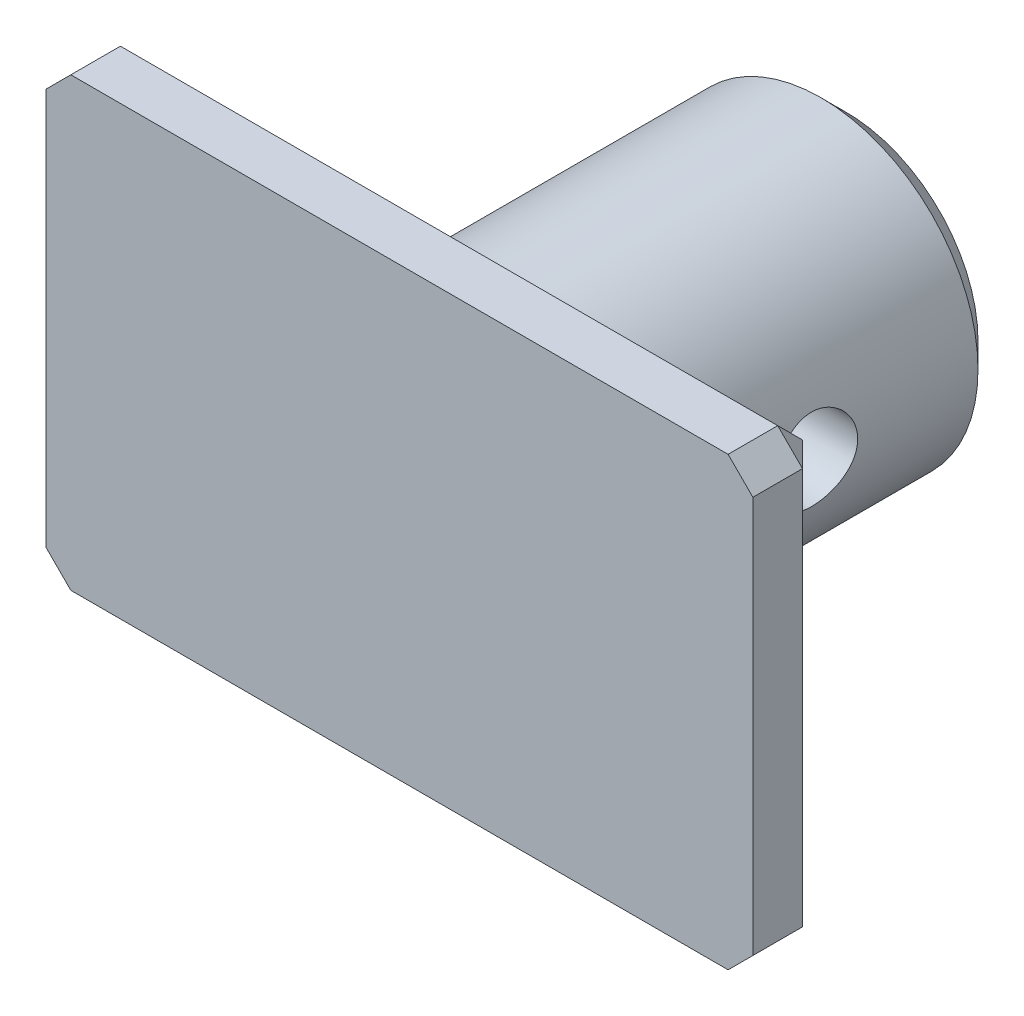
ISO-10303-21;
HEADER;
FILE_DESCRIPTION(('STEP AP214'),'2;1');
FILE_NAME('part.step','',(''),(''),'','','');
FILE_SCHEMA(('AUTOMOTIVE_DESIGN { 1 0 10303 214 1 1 1 1 }'));
ENDSEC;
DATA;
#1=APPLICATION_CONTEXT('core data for automotive mechanical design processes');
#2=APPLICATION_PROTOCOL_DEFINITION('international standard','automotive_design',2000,#1);
#3=PRODUCT_CONTEXT('',#1,'mechanical');
#4=PRODUCT('Part','Part','',(#3));
#5=PRODUCT_RELATED_PRODUCT_CATEGORY('part','',(#4));
#6=PRODUCT_DEFINITION_FORMATION('','',#4);
#7=PRODUCT_DEFINITION_CONTEXT('part definition',#1,'design');
#8=PRODUCT_DEFINITION('design','',#6,#7);
#9=PRODUCT_DEFINITION_SHAPE('','',#8);
#10=(LENGTH_UNIT() NAMED_UNIT(*) SI_UNIT(.MILLI.,.METRE.));
#11=(NAMED_UNIT(*) PLANE_ANGLE_UNIT() SI_UNIT($,.RADIAN.));
#12=(NAMED_UNIT(*) SI_UNIT($,.STERADIAN.) SOLID_ANGLE_UNIT());
#13=UNCERTAINTY_MEASURE_WITH_UNIT(LENGTH_MEASURE(1.E-05),#10,'distance_accuracy_value','');
#14=(GEOMETRIC_REPRESENTATION_CONTEXT(3) GLOBAL_UNCERTAINTY_ASSIGNED_CONTEXT((#13)) GLOBAL_UNIT_ASSIGNED_CONTEXT((#10,
#11,#12)) REPRESENTATION_CONTEXT('',''));
#15=CARTESIAN_POINT('',(0.,0.,0.));
#16=DIRECTION('',(0.,0.,1.));
#17=DIRECTION('',(1.,0.,0.));
#18=AXIS2_PLACEMENT_3D('',#15,#16,#17);
#19=CARTESIAN_POINT('',(0.,0.,18.));
#20=DIRECTION('',(0.,0.,1.));
#21=DIRECTION('',(1.,0.,0.));
#22=AXIS2_PLACEMENT_3D('',#19,#20,#21);
#23=PLANE('',#22);
#24=DIRECTION('',(-1.,0.,0.));
#25=VECTOR('',#24,1.);
#26=CARTESIAN_POINT('',(-14.25,9.,18.));
#27=LINE('',#26,#25);
#28=CARTESIAN_POINT('',(13.25,9.,18.));
#29=VERTEX_POINT('',#28);
#30=CARTESIAN_POINT('',(-13.25,9.,18.));
#31=VERTEX_POINT('',#30);
#32=EDGE_CURVE('E53',#29,#31,#27,.T.);
#33=ORIENTED_EDGE('',*,*,#32,.T.);
#34=DIRECTION('',(0.707106781186548,0.707106781186548,0.));
#35=VECTOR('',#34,1.);
#36=CARTESIAN_POINT('',(-14.25,8.00000000000001,18.));
#37=LINE('',#36,#35);
#38=CARTESIAN_POINT('',(-14.25,8.00000000000001,18.));
#39=VERTEX_POINT('',#38);
#40=EDGE_CURVE('E141',#31,#39,#37,.F.);
#41=ORIENTED_EDGE('',*,*,#40,.T.);
#42=DIRECTION('',(0.,1.,0.));
#43=VECTOR('',#42,1.);
#44=CARTESIAN_POINT('',(-14.25,9.,18.));
#45=LINE('',#44,#43);
#46=CARTESIAN_POINT('',(-14.25,-8.00000000000001,18.));
#47=VERTEX_POINT('',#46);
#48=EDGE_CURVE('E139',#47,#39,#45,.T.);
#49=ORIENTED_EDGE('',*,*,#48,.F.);
#50=DIRECTION('',(-0.707106781186548,0.707106781186548,0.));
#51=VECTOR('',#50,1.);
#52=CARTESIAN_POINT('',(-13.25,-9.,18.));
#53=LINE('',#52,#51);
#54=CARTESIAN_POINT('',(-13.25,-9.,18.));
#55=VERTEX_POINT('',#54);
#56=EDGE_CURVE('E11',#47,#55,#53,.F.);
#57=ORIENTED_EDGE('',*,*,#56,.T.);
#58=DIRECTION('',(1.,0.,0.));
#59=VECTOR('',#58,1.);
#60=CARTESIAN_POINT('',(-14.25,-9.,18.));
#61=LINE('',#60,#59);
#62=CARTESIAN_POINT('',(13.25,-9.,18.));
#63=VERTEX_POINT('',#62);
#64=EDGE_CURVE('E115',#55,#63,#61,.T.);
#65=ORIENTED_EDGE('',*,*,#64,.T.);
#66=DIRECTION('',(-0.707106781186548,-0.707106781186548,0.));
#67=VECTOR('',#66,1.);
#68=CARTESIAN_POINT('',(14.25,-8.00000000000001,18.));
#69=LINE('',#68,#67);
#70=CARTESIAN_POINT('',(14.25,-8.00000000000001,18.));
#71=VERTEX_POINT('',#70);
#72=EDGE_CURVE('E145',#63,#71,#69,.F.);
#73=ORIENTED_EDGE('',*,*,#72,.T.);
#74=DIRECTION('',(0.,-1.,0.));
#75=VECTOR('',#74,1.);
#76=CARTESIAN_POINT('',(14.25,9.,18.));
#77=LINE('',#76,#75);
#78=CARTESIAN_POINT('',(14.25,8.00000000000001,18.));
#79=VERTEX_POINT('',#78);
#80=EDGE_CURVE('E149',#79,#71,#77,.T.);
#81=ORIENTED_EDGE('',*,*,#80,.F.);
#82=DIRECTION('',(0.707106781186548,-0.707106781186548,0.));
#83=VECTOR('',#82,1.);
#84=CARTESIAN_POINT('',(13.25,9.,18.));
#85=LINE('',#84,#83);
#86=EDGE_CURVE('E60',#79,#29,#85,.F.);
#87=ORIENTED_EDGE('',*,*,#86,.T.);
#88=EDGE_LOOP('',(#33,#41,#49,#57,#65,#73,#81,#87));
#89=FACE_BOUND('',#88,.T.);
#90=ADVANCED_FACE('F37',(#89),#23,.T.);
#91=CARTESIAN_POINT('',(0.,0.,15.));
#92=DIRECTION('',(0.,0.,-1.));
#93=DIRECTION('',(-1.,0.,0.));
#94=AXIS2_PLACEMENT_3D('',#91,#92,#93);
#95=CYLINDRICAL_SURFACE('',#94,6.325);
#96=CARTESIAN_POINT('',(-6.325,0.,9.15));
#97=CARTESIAN_POINT('',(-6.32499856131455,-0.0910322054731646,9.14999769337223));
#98=CARTESIAN_POINT('',(-6.32301531046819,-0.182089485967163,9.142441199785));
#99=CARTESIAN_POINT('',(-6.31529617970102,-0.361585686070217,9.11246545250106));
#100=CARTESIAN_POINT('',(-6.30955838038188,-0.450023242240684,9.09003859670742));
#101=CARTESIAN_POINT('',(-6.29496418984029,-0.62166270831009,9.03109729200295));
#102=CARTESIAN_POINT('',(-6.28611172353453,-0.704871052928939,8.99460056758401));
#103=CARTESIAN_POINT('',(-6.26622630677098,-0.863985210201318,8.90862006233914));
#104=CARTESIAN_POINT('',(-6.25519323609731,-0.939890619903711,8.859135565453));
#105=CARTESIAN_POINT('',(-6.23186539066367,-1.08393476804363,8.74742040833982));
#106=CARTESIAN_POINT('',(-6.21954978517394,-1.15188768080737,8.684954489013));
#107=CARTESIAN_POINT('',(-6.19518029857379,-1.27648151509558,8.54955285014264));
#108=CARTESIAN_POINT('',(-6.18312644980707,-1.33312104570344,8.47661584513041));
#109=CARTESIAN_POINT('',(-6.1604332808511,-1.43437496619506,8.32087351762745));
#110=CARTESIAN_POINT('',(-6.14982030114327,-1.47877767556071,8.23792638443637));
#111=CARTESIAN_POINT('',(-6.1315159105228,-1.55293485480052,8.06542281460891));
#112=CARTESIAN_POINT('',(-6.1238239865911,-1.58269189713531,7.97586754184932));
#113=CARTESIAN_POINT('',(-6.11244734117569,-1.62607173027844,7.79474271537195));
#114=CARTESIAN_POINT('',(-6.10867932701248,-1.64003045410787,7.70325897547789));
#115=CARTESIAN_POINT('',(-6.10532810861099,-1.65246440686233,7.51917661430874));
#116=CARTESIAN_POINT('',(-6.10574415865244,-1.65094239489802,7.42657819463989));
#117=CARTESIAN_POINT('',(-6.1106393980737,-1.63272524761743,7.24550009622707));
#118=CARTESIAN_POINT('',(-6.1150103223932,-1.61643438794746,7.15697635646733));
#119=CARTESIAN_POINT('',(-6.12714975348629,-1.56978856295169,6.9839640952734));
#120=CARTESIAN_POINT('',(-6.13491852137129,-1.53943251675893,6.8994758845079));
#121=CARTESIAN_POINT('',(-6.15307496798906,-1.46518326665299,6.73586849322222));
#122=CARTESIAN_POINT('',(-6.16349018312992,-1.42114657009164,6.6568176180494));
#123=CARTESIAN_POINT('',(-6.1857509276799,-1.32088625007631,6.50708434144896));
#124=CARTESIAN_POINT('',(-6.1975967274585,-1.26466032134967,6.4364035269133));
#125=CARTESIAN_POINT('',(-6.22183642047438,-1.13954090754168,6.30310444475401));
#126=CARTESIAN_POINT('',(-6.23423589149332,-1.07030733309335,6.24080597975507));
#127=CARTESIAN_POINT('',(-6.2578542104328,-0.922224946710498,6.1286398744525));
#128=CARTESIAN_POINT('',(-6.26907301568982,-0.84337578753762,6.07877268326556));
#129=CARTESIAN_POINT('',(-6.28913013114926,-0.677819058833768,5.99275222566085));
#130=CARTESIAN_POINT('',(-6.29795871995091,-0.591081258972824,5.95665472662014));
#131=CARTESIAN_POINT('',(-6.31217026098355,-0.412485923968814,5.89964476106412));
#132=CARTESIAN_POINT('',(-6.31755393271283,-0.320629462258564,5.87872912357373));
#133=CARTESIAN_POINT('',(-6.32416106283539,-0.1371352929597,5.85317385472919));
#134=CARTESIAN_POINT('',(-6.32549569157974,-0.0455620862506204,5.84809917866407));
#135=CARTESIAN_POINT('',(-6.32417292078247,0.13712625960047,5.85317136857988));
#136=CARTESIAN_POINT('',(-6.32151591483094,0.228241443016467,5.86331673380775));
#137=CARTESIAN_POINT('',(-6.31258002959978,0.405889108884665,5.89818352506428));
#138=CARTESIAN_POINT('',(-6.3063610131083,0.492472133181024,5.92266418216553));
#139=CARTESIAN_POINT('',(-6.29100484593019,0.660295586751497,5.98522867473623));
#140=CARTESIAN_POINT('',(-6.28186738623073,0.741535449177921,6.02331395075089));
#141=CARTESIAN_POINT('',(-6.26142533058848,0.898071287977835,6.11282630505247));
#142=CARTESIAN_POINT('',(-6.25008294835308,0.973225452561208,6.16449253623182));
#143=CARTESIAN_POINT('',(-6.22654306904705,1.11395044478543,6.27939776841896));
#144=CARTESIAN_POINT('',(-6.21434541088685,1.17951945986885,6.34263895317853));
#145=CARTESIAN_POINT('',(-6.19006380590026,1.30103190794256,6.48092571064283));
#146=CARTESIAN_POINT('',(-6.17799174295186,1.35666898866166,6.55624304519588));
#147=CARTESIAN_POINT('',(-6.15569076023264,1.45451864545152,6.71539817088361));
#148=CARTESIAN_POINT('',(-6.1454617612781,1.49673179831526,6.79923559572676));
#149=CARTESIAN_POINT('',(-6.1281212617238,1.5662177149613,6.97261921113466));
#150=CARTESIAN_POINT('',(-6.12099153437167,1.59357807127583,7.06212837744134));
#151=CARTESIAN_POINT('',(-6.11064761722742,1.63279817793899,7.2446932178392));
#152=CARTESIAN_POINT('',(-6.10743247886618,1.64466168347949,7.33774802712442));
#153=CARTESIAN_POINT('',(-6.10535857680888,1.65234222685977,7.52163311779782));
#154=CARTESIAN_POINT('',(-6.10636640421022,1.64865064872988,7.61244168484481));
#155=CARTESIAN_POINT('',(-6.11231390885249,1.6264602560574,7.79209330915974));
#156=CARTESIAN_POINT('',(-6.11725349303262,1.60796179197911,7.88093641289709));
#157=CARTESIAN_POINT('',(-6.13043029944553,1.55696188248222,8.05354660154899));
#158=CARTESIAN_POINT('',(-6.13864396964498,1.52456032393198,8.13734512269801));
#159=CARTESIAN_POINT('',(-6.15744497413762,1.44675196054621,8.29837884416091));
#160=CARTESIAN_POINT('',(-6.16803266582327,1.4013431972804,8.37561305384654));
#161=CARTESIAN_POINT('',(-6.19076240687573,1.29730203828406,8.52368161316642));
#162=CARTESIAN_POINT('',(-6.20293991767895,1.23833230871056,8.59427352371868));
#163=CARTESIAN_POINT('',(-6.22727443614992,1.10949032387698,8.72471955231711));
#164=CARTESIAN_POINT('',(-6.23943143817033,1.03961544503086,8.78457107894818));
#165=CARTESIAN_POINT('',(-6.26264869814073,0.889242839575461,8.89302282723351));
#166=CARTESIAN_POINT('',(-6.27368183339888,0.808559004293483,8.94137128254512));
#167=CARTESIAN_POINT('',(-6.29311544887914,0.639925066015488,9.02374151666695));
#168=CARTESIAN_POINT('',(-6.30151768809207,0.551979867820161,9.05777287299947));
#169=CARTESIAN_POINT('',(-6.31360069619525,0.386915955573787,9.1058853729384));
#170=CARTESIAN_POINT('',(-6.31784492526624,0.310536211402962,9.12239089546214));
#171=CARTESIAN_POINT('',(-6.32354506871049,0.156110357811325,9.14444870569039));
#172=CARTESIAN_POINT('',(-6.32500123374046,0.0780643988270182,9.15000197804183));
#173=CARTESIAN_POINT('',(-6.325,0.,9.15));
#174=B_SPLINE_CURVE_WITH_KNOTS('',3,(#96,#97,#98,#99,#100,#101,#102,#103,#104,#105,#106,#107,
#108,#109,#110,#111,#112,#113,#114,#115,#116,#117,#118,#119,#120,#121,#122,#123,#124,#125,#126,
#127,#128,#129,#130,#131,#132,#133,#134,#135,#136,#137,#138,#139,#140,#141,#142,#143,#144,#145,
#146,#147,#148,#149,#150,#151,#152,#153,#154,#155,#156,#157,#158,#159,#160,#161,#162,#163,#164,
#165,#166,#167,#168,#169,#170,#171,#172,#173),.UNSPECIFIED.,.T.,.F.,(4,2,2,2,2,2,2,2,2,2,2,2,2,
2,2,2,2,2,2,2,2,2,2,2,2,2,2,2,2,2,2,2,2,2,2,2,2,2,4),(0.,0.272810407450782,0.545760389970211,
0.818367641953715,1.09098992686326,1.36906794001563,1.64718012027831,1.92983800066096,
2.21244621543278,2.48892502952887,2.7653545680425,3.03443844458203,3.30354300283276,
3.57557127567762,3.847651040467,4.12820764177602,4.40877437755724,4.69046564264395,
4.9720980550527,5.24592463491442,5.51972421622466,5.78905198180485,6.05840827401154,
6.33286891905462,6.60738139781598,6.88927779721525,7.17116208258645,7.45136541423824,
7.73150083450572,8.00285424754877,8.27420123811565,8.54363054455322,8.81310043896691,
9.09018299081152,9.36733230687133,9.65008142115545,9.93264108654146,10.1666098809675,
10.4005576397931),.UNSPECIFIED.);
#175=CARTESIAN_POINT('',(-6.325,0.,9.15));
#176=VERTEX_POINT('',#175);
#177=EDGE_CURVE('E189',#176,#176,#174,.T.);
#178=ORIENTED_EDGE('',*,*,#177,.T.);
#179=EDGE_LOOP('',(#178));
#180=FACE_BOUND('',#179,.T.);
#181=CARTESIAN_POINT('',(6.325,0.,5.85));
#182=CARTESIAN_POINT('',(6.32499856131455,-0.0910322054731656,5.85000230662777));
#183=CARTESIAN_POINT('',(6.32301531046819,-0.182089485967164,5.857558800215));
#184=CARTESIAN_POINT('',(6.31529617970102,-0.361585686070218,5.88753454749894));
#185=CARTESIAN_POINT('',(6.30955838038188,-0.450023242240685,5.90996140329258));
#186=CARTESIAN_POINT('',(6.29496418984029,-0.621662708310091,5.96890270799705));
#187=CARTESIAN_POINT('',(6.28611172353453,-0.70487105292894,6.00539943241599));
#188=CARTESIAN_POINT('',(6.26622630677098,-0.863985210201318,6.09137993766086));
#189=CARTESIAN_POINT('',(6.25519323609731,-0.939890619903712,6.140864434547));
#190=CARTESIAN_POINT('',(6.23186539066367,-1.08393476804363,6.25257959166018));
#191=CARTESIAN_POINT('',(6.21954978517394,-1.15188768080737,6.315045510987));
#192=CARTESIAN_POINT('',(6.19518029857379,-1.27648151509558,6.45044714985736));
#193=CARTESIAN_POINT('',(6.18312644980707,-1.33312104570344,6.52338415486959));
#194=CARTESIAN_POINT('',(6.1604332808511,-1.43437496619506,6.67912648237255));
#195=CARTESIAN_POINT('',(6.14982030114327,-1.47877767556071,6.76207361556363));
#196=CARTESIAN_POINT('',(6.1315159105228,-1.55293485480052,6.93457718539109));
#197=CARTESIAN_POINT('',(6.1238239865911,-1.58269189713531,7.02413245815068));
#198=CARTESIAN_POINT('',(6.11244734117569,-1.62607173027844,7.20525728462805));
#199=CARTESIAN_POINT('',(6.10867932701248,-1.64003045410787,7.29674102452211));
#200=CARTESIAN_POINT('',(6.10532810861099,-1.65246440686233,7.48082338569126));
#201=CARTESIAN_POINT('',(6.10574415865244,-1.65094239489802,7.57342180536011));
#202=CARTESIAN_POINT('',(6.1106393980737,-1.63272524761743,7.75449990377293));
#203=CARTESIAN_POINT('',(6.1150103223932,-1.61643438794746,7.84302364353267));
#204=CARTESIAN_POINT('',(6.12714975348629,-1.56978856295169,8.0160359047266));
#205=CARTESIAN_POINT('',(6.13491852137129,-1.53943251675893,8.1005241154921));
#206=CARTESIAN_POINT('',(6.15307496798906,-1.46518326665299,8.26413150677778));
#207=CARTESIAN_POINT('',(6.16349018312992,-1.42114657009164,8.3431823819506));
#208=CARTESIAN_POINT('',(6.1857509276799,-1.32088625007631,8.49291565855104));
#209=CARTESIAN_POINT('',(6.1975967274585,-1.26466032134967,8.5635964730867));
#210=CARTESIAN_POINT('',(6.22183642047438,-1.13954090754168,8.69689555524599));
#211=CARTESIAN_POINT('',(6.23423589149332,-1.07030733309335,8.75919402024493));
#212=CARTESIAN_POINT('',(6.2578542104328,-0.922224946710497,8.8713601255475));
#213=CARTESIAN_POINT('',(6.26907301568982,-0.843375787537618,8.92122731673444));
#214=CARTESIAN_POINT('',(6.28913013114926,-0.677819058833766,9.00724777433915));
#215=CARTESIAN_POINT('',(6.29795871995091,-0.591081258972822,9.04334527337986));
#216=CARTESIAN_POINT('',(6.31217026098355,-0.412485923968813,9.10035523893588));
#217=CARTESIAN_POINT('',(6.31755393271283,-0.320629462258563,9.12127087642627));
#218=CARTESIAN_POINT('',(6.32416106283539,-0.137135292959699,9.14682614527081));
#219=CARTESIAN_POINT('',(6.32549569157975,-0.0455620862506189,9.15190082133593));
#220=CARTESIAN_POINT('',(6.32417292078247,0.137126259600471,9.14682863142012));
#221=CARTESIAN_POINT('',(6.32151591483094,0.228241443016468,9.13668326619225));
#222=CARTESIAN_POINT('',(6.31258002959978,0.405889108884667,9.10181647493572));
#223=CARTESIAN_POINT('',(6.3063610131083,0.492472133181026,9.07733581783447));
#224=CARTESIAN_POINT('',(6.29100484593019,0.660295586751499,9.01477132526377));
#225=CARTESIAN_POINT('',(6.28186738623073,0.741535449177923,8.9766860492491));
#226=CARTESIAN_POINT('',(6.26142533058848,0.898071287977836,8.88717369494753));
#227=CARTESIAN_POINT('',(6.25008294835308,0.973225452561209,8.83550746376817));
#228=CARTESIAN_POINT('',(6.22654306904705,1.11395044478543,8.72060223158104));
#229=CARTESIAN_POINT('',(6.21434541088685,1.17951945986885,8.65736104682147));
#230=CARTESIAN_POINT('',(6.19006380590026,1.30103190794256,8.51907428935717));
#231=CARTESIAN_POINT('',(6.17799174295186,1.35666898866166,8.44375695480412));
#232=CARTESIAN_POINT('',(6.15569076023264,1.45451864545152,8.28460182911639));
#233=CARTESIAN_POINT('',(6.1454617612781,1.49673179831526,8.20076440427324));
#234=CARTESIAN_POINT('',(6.1281212617238,1.5662177149613,8.02738078886534));
#235=CARTESIAN_POINT('',(6.12099153437167,1.59357807127583,7.93787162255867));
#236=CARTESIAN_POINT('',(6.11064761722742,1.63279817793899,7.7553067821608));
#237=CARTESIAN_POINT('',(6.10743247886618,1.64466168347949,7.66225197287558));
#238=CARTESIAN_POINT('',(6.10535857680888,1.65234222685977,7.47836688220218));
#239=CARTESIAN_POINT('',(6.10636640421022,1.64865064872988,7.38755831515519));
#240=CARTESIAN_POINT('',(6.11231390885249,1.6264602560574,7.20790669084026));
#241=CARTESIAN_POINT('',(6.11725349303262,1.60796179197911,7.11906358710291));
#242=CARTESIAN_POINT('',(6.13043029944553,1.55696188248222,6.94645339845101));
#243=CARTESIAN_POINT('',(6.13864396964498,1.52456032393198,6.86265487730199));
#244=CARTESIAN_POINT('',(6.15744497413762,1.44675196054621,6.70162115583909));
#245=CARTESIAN_POINT('',(6.16803266582327,1.4013431972804,6.62438694615346));
#246=CARTESIAN_POINT('',(6.19076240687573,1.29730203828406,6.47631838683357));
#247=CARTESIAN_POINT('',(6.20293991767895,1.23833230871056,6.40572647628132));
#248=CARTESIAN_POINT('',(6.22727443614992,1.10949032387698,6.27528044768289));
#249=CARTESIAN_POINT('',(6.23943143817033,1.03961544503086,6.21542892105182));
#250=CARTESIAN_POINT('',(6.26264869814073,0.88924283957546,6.10697717276648));
#251=CARTESIAN_POINT('',(6.27368183339888,0.808559004293481,6.05862871745488));
#252=CARTESIAN_POINT('',(6.29311544887914,0.639925066015486,5.97625848333305));
#253=CARTESIAN_POINT('',(6.30151768809207,0.551979867820159,5.94222712700053));
#254=CARTESIAN_POINT('',(6.31360069619525,0.386915955573785,5.89411462706159));
#255=CARTESIAN_POINT('',(6.31784492526624,0.31053621140296,5.87760910453786));
#256=CARTESIAN_POINT('',(6.32354506871049,0.156110357811323,5.85555129430961));
#257=CARTESIAN_POINT('',(6.32500123374046,0.0780643988270168,5.84999802195817));
#258=CARTESIAN_POINT('',(6.325,0.,5.85));
#259=B_SPLINE_CURVE_WITH_KNOTS('',3,(#181,#182,#183,#184,#185,#186,#187,#188,#189,#190,#191,
#192,#193,#194,#195,#196,#197,#198,#199,#200,#201,#202,#203,#204,#205,#206,#207,#208,#209,#210,
#211,#212,#213,#214,#215,#216,#217,#218,#219,#220,#221,#222,#223,#224,#225,#226,#227,#228,#229,
#230,#231,#232,#233,#234,#235,#236,#237,#238,#239,#240,#241,#242,#243,#244,#245,#246,#247,#248,
#249,#250,#251,#252,#253,#254,#255,#256,#257,#258),.UNSPECIFIED.,.T.,.F.,(4,2,2,2,2,2,2,2,2,2,2,
2,2,2,2,2,2,2,2,2,2,2,2,2,2,2,2,2,2,2,2,2,2,2,2,2,2,2,4),(0.,0.272810407450782,
0.545760389970211,0.818367641953714,1.09098992686326,1.36906794001563,1.64718012027831,
1.92983800066096,2.21244621543279,2.48892502952887,2.7653545680425,3.03443844458203,
3.30354300283276,3.57557127567762,3.847651040467,4.12820764177602,4.40877437755724,
4.69046564264395,4.9720980550527,5.24592463491443,5.51972421622466,5.78905198180485,
6.05840827401155,6.33286891905462,6.60738139781598,6.88927779721525,7.17116208258645,
7.45136541423824,7.73150083450573,8.00285424754877,8.27420123811565,8.54363054455322,
8.81310043896691,9.09018299081152,9.36733230687133,9.65008142115545,9.93264108654146,
10.1666098809675,10.4005576397931),.UNSPECIFIED.);
#260=CARTESIAN_POINT('',(6.325,0.,5.85));
#261=VERTEX_POINT('',#260);
#262=EDGE_CURVE('E153',#261,#261,#259,.T.);
#263=ORIENTED_EDGE('',*,*,#262,.T.);
#264=EDGE_LOOP('',(#263));
#265=FACE_BOUND('',#264,.T.);
#266=CARTESIAN_POINT('',(0.,0.,1.));
#267=DIRECTION('',(0.,0.,1.));
#268=DIRECTION('',(1.,0.,0.));
#269=AXIS2_PLACEMENT_3D('',#266,#267,#268);
#270=CIRCLE('',#269,6.325);
#271=CARTESIAN_POINT('',(6.325,0.,1.));
#272=VERTEX_POINT('',#271);
#273=EDGE_CURVE('E186',#272,#272,#270,.T.);
#274=ORIENTED_EDGE('',*,*,#273,.T.);
#275=EDGE_LOOP('',(#274));
#276=FACE_BOUND('',#275,.T.);
#277=CARTESIAN_POINT('',(0.,0.,15.));
#278=DIRECTION('',(0.,0.,1.));
#279=DIRECTION('',(1.,0.,0.));
#280=AXIS2_PLACEMENT_3D('',#277,#278,#279);
#281=CIRCLE('',#280,6.325);
#282=CARTESIAN_POINT('',(6.325,0.,15.));
#283=VERTEX_POINT('',#282);
#284=EDGE_CURVE('E125',#283,#283,#281,.T.);
#285=ORIENTED_EDGE('',*,*,#284,.F.);
#286=EDGE_LOOP('',(#285));
#287=FACE_BOUND('',#286,.T.);
#288=ADVANCED_FACE('F233',(#180,#265,#276,#287),#95,.T.);
#289=CARTESIAN_POINT('',(0.,0.,0.));
#290=DIRECTION('',(0.,0.,1.));
#291=DIRECTION('',(1.,0.,0.));
#292=AXIS2_PLACEMENT_3D('',#289,#290,#291);
#293=PLANE('',#292);
#294=CARTESIAN_POINT('',(0.,0.,0.));
#295=DIRECTION('',(0.,0.,1.));
#296=DIRECTION('',(1.,0.,0.));
#297=AXIS2_PLACEMENT_3D('',#294,#295,#296);
#298=CIRCLE('',#297,5.32499999999999);
#299=CARTESIAN_POINT('',(5.32499999999999,0.,0.));
#300=VERTEX_POINT('',#299);
#301=EDGE_CURVE('E46',#300,#300,#298,.F.);
#302=ORIENTED_EDGE('',*,*,#301,.T.);
#303=EDGE_LOOP('',(#302));
#304=FACE_BOUND('',#303,.T.);
#305=ADVANCED_FACE('F260',(#304),#293,.F.);
#306=CARTESIAN_POINT('',(14.25,9.,18.));
#307=DIRECTION('',(-1.,0.,0.));
#308=DIRECTION('',(0.,-1.,0.));
#309=AXIS2_PLACEMENT_3D('',#306,#307,#308);
#310=PLANE('',#309);
#311=DIRECTION('',(0.,0.,1.));
#312=VECTOR('',#311,1.);
#313=CARTESIAN_POINT('',(14.25,8.00000000000001,18.));
#314=LINE('',#313,#312);
#315=CARTESIAN_POINT('',(14.25,8.00000000000001,16.));
#316=VERTEX_POINT('',#315);
#317=EDGE_CURVE('E164',#316,#79,#314,.T.);
#318=ORIENTED_EDGE('',*,*,#317,.T.);
#319=ORIENTED_EDGE('',*,*,#80,.T.);
#320=DIRECTION('',(0.,0.,-1.));
#321=VECTOR('',#320,1.);
#322=CARTESIAN_POINT('',(14.25,-8.00000000000001,18.));
#323=LINE('',#322,#321);
#324=CARTESIAN_POINT('',(14.25,-8.00000000000001,16.));
#325=VERTEX_POINT('',#324);
#326=EDGE_CURVE('E168',#71,#325,#323,.T.);
#327=ORIENTED_EDGE('',*,*,#326,.T.);
#328=DIRECTION('',(0.,1.,0.));
#329=VECTOR('',#328,1.);
#330=CARTESIAN_POINT('',(14.25,9.,16.));
#331=LINE('',#330,#329);
#332=EDGE_CURVE('E166',#325,#316,#331,.T.);
#333=ORIENTED_EDGE('',*,*,#332,.T.);
#334=EDGE_LOOP('',(#318,#319,#327,#333));
#335=FACE_BOUND('',#334,.T.);
#336=ADVANCED_FACE('F258',(#335),#310,.F.);
#337=CARTESIAN_POINT('',(-14.25,9.,18.));
#338=DIRECTION('',(0.,-1.,0.));
#339=DIRECTION('',(0.,0.,-1.));
#340=AXIS2_PLACEMENT_3D('',#337,#338,#339);
#341=PLANE('',#340);
#342=DIRECTION('',(0.,0.,1.));
#343=VECTOR('',#342,1.);
#344=CARTESIAN_POINT('',(-13.25,9.,18.));
#345=LINE('',#344,#343);
#346=CARTESIAN_POINT('',(-13.25,9.,16.));
#347=VERTEX_POINT('',#346);
#348=EDGE_CURVE('E184',#347,#31,#345,.T.);
#349=ORIENTED_EDGE('',*,*,#348,.T.);
#350=ORIENTED_EDGE('',*,*,#32,.F.);
#351=DIRECTION('',(0.,0.,-1.));
#352=VECTOR('',#351,1.);
#353=CARTESIAN_POINT('',(13.25,9.,18.));
#354=LINE('',#353,#352);
#355=CARTESIAN_POINT('',(13.25,9.,16.));
#356=VERTEX_POINT('',#355);
#357=EDGE_CURVE('E180',#29,#356,#354,.T.);
#358=ORIENTED_EDGE('',*,*,#357,.T.);
#359=DIRECTION('',(-1.,0.,0.));
#360=VECTOR('',#359,1.);
#361=CARTESIAN_POINT('',(-14.25,9.,16.));
#362=LINE('',#361,#360);
#363=EDGE_CURVE('E182',#356,#347,#362,.T.);
#364=ORIENTED_EDGE('',*,*,#363,.T.);
#365=EDGE_LOOP('',(#349,#350,#358,#364));
#366=FACE_BOUND('',#365,.T.);
#367=ADVANCED_FACE('F255',(#366),#341,.F.);
#368=CARTESIAN_POINT('',(-14.25,9.,18.));
#369=DIRECTION('',(1.,0.,0.));
#370=DIRECTION('',(0.,1.,0.));
#371=AXIS2_PLACEMENT_3D('',#368,#369,#370);
#372=PLANE('',#371);
#373=DIRECTION('',(0.,0.,1.));
#374=VECTOR('',#373,1.);
#375=CARTESIAN_POINT('',(-14.25,-8.00000000000001,18.));
#376=LINE('',#375,#374);
#377=CARTESIAN_POINT('',(-14.25,-8.00000000000001,16.));
#378=VERTEX_POINT('',#377);
#379=EDGE_CURVE('E162',#378,#47,#376,.T.);
#380=ORIENTED_EDGE('',*,*,#379,.T.);
#381=ORIENTED_EDGE('',*,*,#48,.T.);
#382=DIRECTION('',(0.,0.,-1.));
#383=VECTOR('',#382,1.);
#384=CARTESIAN_POINT('',(-14.25,8.00000000000001,18.));
#385=LINE('',#384,#383);
#386=CARTESIAN_POINT('',(-14.25,8.00000000000001,16.));
#387=VERTEX_POINT('',#386);
#388=EDGE_CURVE('E158',#39,#387,#385,.T.);
#389=ORIENTED_EDGE('',*,*,#388,.T.);
#390=DIRECTION('',(0.,-1.,0.));
#391=VECTOR('',#390,1.);
#392=CARTESIAN_POINT('',(-14.25,9.,16.));
#393=LINE('',#392,#391);
#394=EDGE_CURVE('E160',#387,#378,#393,.T.);
#395=ORIENTED_EDGE('',*,*,#394,.T.);
#396=EDGE_LOOP('',(#380,#381,#389,#395));
#397=FACE_BOUND('',#396,.T.);
#398=ADVANCED_FACE('F252',(#397),#372,.F.);
#399=CARTESIAN_POINT('',(-14.25,-9.,18.));
#400=DIRECTION('',(0.,1.,0.));
#401=DIRECTION('',(0.,0.,1.));
#402=AXIS2_PLACEMENT_3D('',#399,#400,#401);
#403=PLANE('',#402);
#404=DIRECTION('',(0.,0.,1.));
#405=VECTOR('',#404,1.);
#406=CARTESIAN_POINT('',(13.25,-9.,18.));
#407=LINE('',#406,#405);
#408=CARTESIAN_POINT('',(13.25,-9.,16.));
#409=VERTEX_POINT('',#408);
#410=EDGE_CURVE('E121',#409,#63,#407,.T.);
#411=ORIENTED_EDGE('',*,*,#410,.T.);
#412=ORIENTED_EDGE('',*,*,#64,.F.);
#413=DIRECTION('',(0.,0.,-1.));
#414=VECTOR('',#413,1.);
#415=CARTESIAN_POINT('',(-13.25,-9.,18.));
#416=LINE('',#415,#414);
#417=CARTESIAN_POINT('',(-13.25,-9.,16.));
#418=VERTEX_POINT('',#417);
#419=EDGE_CURVE('E118',#55,#418,#416,.T.);
#420=ORIENTED_EDGE('',*,*,#419,.T.);
#421=DIRECTION('',(1.,0.,0.));
#422=VECTOR('',#421,1.);
#423=CARTESIAN_POINT('',(-14.25,-9.,16.));
#424=LINE('',#423,#422);
#425=EDGE_CURVE('E135',#418,#409,#424,.T.);
#426=ORIENTED_EDGE('',*,*,#425,.T.);
#427=EDGE_LOOP('',(#411,#412,#420,#426));
#428=FACE_BOUND('',#427,.T.);
#429=ADVANCED_FACE('F117',(#428),#403,.F.);
#430=CARTESIAN_POINT('',(0.,0.,15.));
#431=DIRECTION('',(0.,0.,1.));
#432=DIRECTION('',(1.,0.,0.));
#433=AXIS2_PLACEMENT_3D('',#430,#431,#432);
#434=PLANE('',#433);
#435=DIRECTION('',(0.,-1.,0.));
#436=VECTOR('',#435,1.);
#437=CARTESIAN_POINT('',(13.25,0.,15.));
#438=LINE('',#437,#436);
#439=CARTESIAN_POINT('',(13.25,8.00000000000001,15.));
#440=VERTEX_POINT('',#439);
#441=CARTESIAN_POINT('',(13.25,-8.00000000000001,15.));
#442=VERTEX_POINT('',#441);
#443=EDGE_CURVE('E134',#440,#442,#438,.T.);
#444=ORIENTED_EDGE('',*,*,#443,.T.);
#445=DIRECTION('',(-1.,0.,0.));
#446=VECTOR('',#445,1.);
#447=CARTESIAN_POINT('',(0.,-8.00000000000001,15.));
#448=LINE('',#447,#446);
#449=CARTESIAN_POINT('',(-13.25,-8.00000000000001,15.));
#450=VERTEX_POINT('',#449);
#451=EDGE_CURVE('E177',#442,#450,#448,.T.);
#452=ORIENTED_EDGE('',*,*,#451,.T.);
#453=DIRECTION('',(0.,1.,0.));
#454=VECTOR('',#453,1.);
#455=CARTESIAN_POINT('',(-13.25,0.,15.));
#456=LINE('',#455,#454);
#457=CARTESIAN_POINT('',(-13.25,8.00000000000001,15.));
#458=VERTEX_POINT('',#457);
#459=EDGE_CURVE('E175',#450,#458,#456,.T.);
#460=ORIENTED_EDGE('',*,*,#459,.T.);
#461=DIRECTION('',(1.,0.,0.));
#462=VECTOR('',#461,1.);
#463=CARTESIAN_POINT('',(0.,8.00000000000001,15.));
#464=LINE('',#463,#462);
#465=EDGE_CURVE('E173',#458,#440,#464,.T.);
#466=ORIENTED_EDGE('',*,*,#465,.T.);
#467=EDGE_LOOP('',(#444,#452,#460,#466));
#468=FACE_BOUND('',#467,.T.);
#469=ORIENTED_EDGE('',*,*,#284,.T.);
#470=EDGE_LOOP('',(#469));
#471=FACE_BOUND('',#470,.T.);
#472=ADVANCED_FACE('F245',(#468,#471),#434,.F.);
#473=CARTESIAN_POINT('',(13.25,9.,18.));
#474=DIRECTION('',(-0.707106781186547,-0.707106781186547,0.));
#475=DIRECTION('',(0.,0.,-1.));
#476=AXIS2_PLACEMENT_3D('',#473,#474,#475);
#477=PLANE('',#476);
#478=ORIENTED_EDGE('',*,*,#86,.F.);
#479=ORIENTED_EDGE('',*,*,#317,.F.);
#480=DIRECTION('',(-0.707106781186547,0.707106781186547,0.));
#481=VECTOR('',#480,1.);
#482=CARTESIAN_POINT('',(13.75,8.5,16.));
#483=LINE('',#482,#481);
#484=EDGE_CURVE('E154',#356,#316,#483,.F.);
#485=ORIENTED_EDGE('',*,*,#484,.F.);
#486=ORIENTED_EDGE('',*,*,#357,.F.);
#487=EDGE_LOOP('',(#478,#479,#485,#486));
#488=FACE_BOUND('',#487,.T.);
#489=ADVANCED_FACE('F248',(#488),#477,.F.);
#490=CARTESIAN_POINT('',(13.25,8.00000000000001,15.));
#491=DIRECTION('',(0.577350269189626,0.577350269189626,-0.577350269189626));
#492=DIRECTION('',(-0.707106781186547,0.,-0.707106781186547));
#493=AXIS2_PLACEMENT_3D('',#490,#491,#492);
#494=PLANE('',#493);
#495=DIRECTION('',(0.,-0.707106781186547,-0.707106781186547));
#496=VECTOR('',#495,1.);
#497=CARTESIAN_POINT('',(13.25,8.00000000000001,15.));
#498=LINE('',#497,#496);
#499=EDGE_CURVE('E212',#356,#440,#498,.T.);
#500=ORIENTED_EDGE('',*,*,#499,.F.);
#501=ORIENTED_EDGE('',*,*,#484,.T.);
#502=DIRECTION('',(0.707106781186547,0.,0.707106781186547));
#503=VECTOR('',#502,1.);
#504=CARTESIAN_POINT('',(13.25,8.00000000000001,15.));
#505=LINE('',#504,#503);
#506=EDGE_CURVE('E215',#440,#316,#505,.T.);
#507=ORIENTED_EDGE('',*,*,#506,.F.);
#508=EDGE_LOOP('',(#500,#501,#507));
#509=FACE_BOUND('',#508,.T.);
#510=ADVANCED_FACE('F349',(#509),#494,.T.);
#511=CARTESIAN_POINT('',(14.25,-8.00000000000001,18.));
#512=DIRECTION('',(-0.707106781186547,0.707106781186547,0.));
#513=DIRECTION('',(0.,0.,-1.));
#514=AXIS2_PLACEMENT_3D('',#511,#512,#513);
#515=PLANE('',#514);
#516=ORIENTED_EDGE('',*,*,#72,.F.);
#517=ORIENTED_EDGE('',*,*,#410,.F.);
#518=DIRECTION('',(0.707106781186547,0.707106781186547,0.));
#519=VECTOR('',#518,1.);
#520=CARTESIAN_POINT('',(13.25,-9.,16.));
#521=LINE('',#520,#519);
#522=EDGE_CURVE('E209',#325,#409,#521,.F.);
#523=ORIENTED_EDGE('',*,*,#522,.F.);
#524=ORIENTED_EDGE('',*,*,#326,.F.);
#525=EDGE_LOOP('',(#516,#517,#523,#524));
#526=FACE_BOUND('',#525,.T.);
#527=ADVANCED_FACE('F342',(#526),#515,.F.);
#528=CARTESIAN_POINT('',(14.25,9.,16.));
#529=DIRECTION('',(-0.707106781186547,0.,0.707106781186547));
#530=DIRECTION('',(0.,1.,0.));
#531=AXIS2_PLACEMENT_3D('',#528,#529,#530);
#532=PLANE('',#531);
#533=ORIENTED_EDGE('',*,*,#506,.T.);
#534=ORIENTED_EDGE('',*,*,#332,.F.);
#535=DIRECTION('',(-0.707106781186548,0.,-0.707106781186548));
#536=VECTOR('',#535,1.);
#537=CARTESIAN_POINT('',(13.75,-8.00000000000001,15.5));
#538=LINE('',#537,#536);
#539=EDGE_CURVE('E206',#442,#325,#538,.F.);
#540=ORIENTED_EDGE('',*,*,#539,.F.);
#541=ORIENTED_EDGE('',*,*,#443,.F.);
#542=EDGE_LOOP('',(#533,#534,#540,#541));
#543=FACE_BOUND('',#542,.T.);
#544=ADVANCED_FACE('F335',(#543),#532,.F.);
#545=CARTESIAN_POINT('',(-14.25,9.,16.));
#546=DIRECTION('',(0.,-0.707106781186547,0.707106781186547));
#547=DIRECTION('',(-1.,0.,0.));
#548=AXIS2_PLACEMENT_3D('',#545,#546,#547);
#549=PLANE('',#548);
#550=ORIENTED_EDGE('',*,*,#499,.T.);
#551=ORIENTED_EDGE('',*,*,#465,.F.);
#552=DIRECTION('',(0.,0.707106781186547,0.707106781186547));
#553=VECTOR('',#552,1.);
#554=CARTESIAN_POINT('',(-13.25,8.00000000000001,15.));
#555=LINE('',#554,#553);
#556=EDGE_CURVE('E203',#347,#458,#555,.F.);
#557=ORIENTED_EDGE('',*,*,#556,.F.);
#558=ORIENTED_EDGE('',*,*,#363,.F.);
#559=EDGE_LOOP('',(#550,#551,#557,#558));
#560=FACE_BOUND('',#559,.T.);
#561=ADVANCED_FACE('F328',(#560),#549,.F.);
#562=CARTESIAN_POINT('',(13.25,-9.,16.));
#563=DIRECTION('',(0.577350269189626,-0.577350269189626,-0.577350269189626));
#564=DIRECTION('',(-0.707106781186547,0.,-0.707106781186547));
#565=AXIS2_PLACEMENT_3D('',#562,#563,#564);
#566=PLANE('',#565);
#567=ORIENTED_EDGE('',*,*,#539,.T.);
#568=ORIENTED_EDGE('',*,*,#522,.T.);
#569=DIRECTION('',(0.,-0.707106781186547,0.707106781186547));
#570=VECTOR('',#569,1.);
#571=CARTESIAN_POINT('',(13.25,-9.,16.));
#572=LINE('',#571,#570);
#573=EDGE_CURVE('E200',#442,#409,#572,.T.);
#574=ORIENTED_EDGE('',*,*,#573,.F.);
#575=EDGE_LOOP('',(#567,#568,#574));
#576=FACE_BOUND('',#575,.T.);
#577=ADVANCED_FACE('F321',(#576),#566,.T.);
#578=CARTESIAN_POINT('',(-13.25,8.00000000000001,15.));
#579=DIRECTION('',(-0.577350269189626,0.577350269189626,-0.577350269189626));
#580=DIRECTION('',(-0.707106781186547,0.,0.707106781186547));
#581=AXIS2_PLACEMENT_3D('',#578,#579,#580);
#582=PLANE('',#581);
#583=DIRECTION('',(-0.707106781186547,-0.707106781186547,0.));
#584=VECTOR('',#583,1.);
#585=CARTESIAN_POINT('',(-13.75,8.5,16.));
#586=LINE('',#585,#584);
#587=EDGE_CURVE('E194',#347,#387,#586,.T.);
#588=ORIENTED_EDGE('',*,*,#587,.F.);
#589=ORIENTED_EDGE('',*,*,#556,.T.);
#590=DIRECTION('',(0.707106781186548,0.,-0.707106781186548));
#591=VECTOR('',#590,1.);
#592=CARTESIAN_POINT('',(-13.25,8.00000000000001,15.));
#593=LINE('',#592,#591);
#594=EDGE_CURVE('E197',#387,#458,#593,.T.);
#595=ORIENTED_EDGE('',*,*,#594,.F.);
#596=EDGE_LOOP('',(#588,#589,#595));
#597=FACE_BOUND('',#596,.T.);
#598=ADVANCED_FACE('F314',(#597),#582,.T.);
#599=CARTESIAN_POINT('',(-14.25,-9.,16.));
#600=DIRECTION('',(0.,0.707106781186547,0.707106781186547));
#601=DIRECTION('',(1.,0.,0.));
#602=AXIS2_PLACEMENT_3D('',#599,#600,#601);
#603=PLANE('',#602);
#604=ORIENTED_EDGE('',*,*,#573,.T.);
#605=ORIENTED_EDGE('',*,*,#425,.F.);
#606=DIRECTION('',(0.,0.707106781186547,-0.707106781186547));
#607=VECTOR('',#606,1.);
#608=CARTESIAN_POINT('',(-13.25,-8.00000000000001,15.));
#609=LINE('',#608,#607);
#610=EDGE_CURVE('E191',#450,#418,#609,.F.);
#611=ORIENTED_EDGE('',*,*,#610,.F.);
#612=ORIENTED_EDGE('',*,*,#451,.F.);
#613=EDGE_LOOP('',(#604,#605,#611,#612));
#614=FACE_BOUND('',#613,.T.);
#615=ADVANCED_FACE('F307',(#614),#603,.F.);
#616=CARTESIAN_POINT('',(-14.25,9.,16.));
#617=DIRECTION('',(0.707106781186547,0.,0.707106781186547));
#618=DIRECTION('',(0.,-1.,0.));
#619=AXIS2_PLACEMENT_3D('',#616,#617,#618);
#620=PLANE('',#619);
#621=ORIENTED_EDGE('',*,*,#594,.T.);
#622=ORIENTED_EDGE('',*,*,#459,.F.);
#623=DIRECTION('',(-0.707106781186547,0.,0.707106781186547));
#624=VECTOR('',#623,1.);
#625=CARTESIAN_POINT('',(-13.25,-8.00000000000001,15.));
#626=LINE('',#625,#624);
#627=EDGE_CURVE('E188',#378,#450,#626,.F.);
#628=ORIENTED_EDGE('',*,*,#627,.F.);
#629=ORIENTED_EDGE('',*,*,#394,.F.);
#630=EDGE_LOOP('',(#621,#622,#628,#629));
#631=FACE_BOUND('',#630,.T.);
#632=ADVANCED_FACE('F300',(#631),#620,.F.);
#633=CARTESIAN_POINT('',(-14.25,8.00000000000001,18.));
#634=DIRECTION('',(0.707106781186547,-0.707106781186547,0.));
#635=DIRECTION('',(0.,0.,-1.));
#636=AXIS2_PLACEMENT_3D('',#633,#634,#635);
#637=PLANE('',#636);
#638=ORIENTED_EDGE('',*,*,#40,.F.);
#639=ORIENTED_EDGE('',*,*,#348,.F.);
#640=ORIENTED_EDGE('',*,*,#587,.T.);
#641=ORIENTED_EDGE('',*,*,#388,.F.);
#642=EDGE_LOOP('',(#638,#639,#640,#641));
#643=FACE_BOUND('',#642,.T.);
#644=ADVANCED_FACE('F284',(#643),#637,.F.);
#645=CARTESIAN_POINT('',(-13.25,-8.00000000000001,15.));
#646=DIRECTION('',(-0.577350269189626,-0.577350269189626,-0.577350269189626));
#647=DIRECTION('',(-0.707106781186547,0.,0.707106781186547));
#648=AXIS2_PLACEMENT_3D('',#645,#646,#647);
#649=PLANE('',#648);
#650=ORIENTED_EDGE('',*,*,#627,.T.);
#651=ORIENTED_EDGE('',*,*,#610,.T.);
#652=DIRECTION('',(0.707106781186547,-0.707106781186547,0.));
#653=VECTOR('',#652,1.);
#654=CARTESIAN_POINT('',(-13.75,-8.5,16.));
#655=LINE('',#654,#653);
#656=EDGE_CURVE('E133',#378,#418,#655,.T.);
#657=ORIENTED_EDGE('',*,*,#656,.F.);
#658=EDGE_LOOP('',(#650,#651,#657));
#659=FACE_BOUND('',#658,.T.);
#660=ADVANCED_FACE('F280',(#659),#649,.T.);
#661=CARTESIAN_POINT('',(-13.25,-9.,18.));
#662=DIRECTION('',(0.707106781186547,0.707106781186547,0.));
#663=DIRECTION('',(0.,0.,-1.));
#664=AXIS2_PLACEMENT_3D('',#661,#662,#663);
#665=PLANE('',#664);
#666=ORIENTED_EDGE('',*,*,#56,.F.);
#667=ORIENTED_EDGE('',*,*,#379,.F.);
#668=ORIENTED_EDGE('',*,*,#656,.T.);
#669=ORIENTED_EDGE('',*,*,#419,.F.);
#670=EDGE_LOOP('',(#666,#667,#668,#669));
#671=FACE_BOUND('',#670,.T.);
#672=ADVANCED_FACE('F129',(#671),#665,.F.);
#673=CARTESIAN_POINT('',(0.,0.,1.));
#674=DIRECTION('',(0.,0.,1.));
#675=DIRECTION('',(1.,0.,0.));
#676=AXIS2_PLACEMENT_3D('',#673,#674,#675);
#677=CONICAL_SURFACE('',#676,6.325,0.785398163397452);
#678=ORIENTED_EDGE('',*,*,#301,.F.);
#679=EDGE_LOOP('',(#678));
#680=FACE_BOUND('',#679,.T.);
#681=ORIENTED_EDGE('',*,*,#273,.F.);
#682=EDGE_LOOP('',(#681));
#683=FACE_BOUND('',#682,.T.);
#684=ADVANCED_FACE('F40',(#680,#683),#677,.T.);
#685=CARTESIAN_POINT('',(-14.25,0.,7.5));
#686=DIRECTION('',(1.,0.,0.));
#687=DIRECTION('',(0.,0.,-1.));
#688=AXIS2_PLACEMENT_3D('',#685,#686,#687);
#689=CYLINDRICAL_SURFACE('',#688,1.65);
#690=ORIENTED_EDGE('',*,*,#262,.F.);
#691=EDGE_LOOP('',(#690));
#692=FACE_BOUND('',#691,.T.);
#693=ORIENTED_EDGE('',*,*,#177,.F.);
#694=EDGE_LOOP('',(#693));
#695=FACE_BOUND('',#694,.T.);
#696=ADVANCED_FACE('F237',(#692,#695),#689,.F.);
#697=CLOSED_SHELL('',(#90,#288,#305,#336,#367,#398,#429,#472,#489,#510,#527,#544,#561,#577,#598,
#615,#632,#644,#660,#672,#684,#696));
#698=MANIFOLD_SOLID_BREP('B2',#697);
#699=ADVANCED_BREP_SHAPE_REPRESENTATION('',(#18,#698),#14);
#700=SHAPE_DEFINITION_REPRESENTATION(#9,#699);
ENDSEC;
END-ISO-10303-21;
